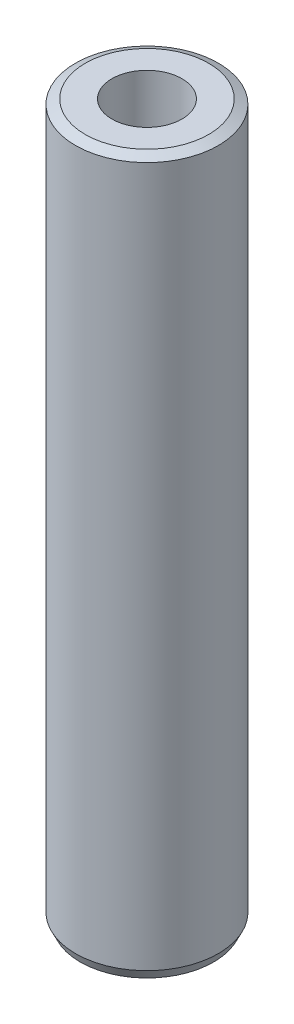
ISO-10303-21;
HEADER;
FILE_DESCRIPTION(('STEP AP214'),'2;1');
FILE_NAME('part.step','',(''),(''),'','','');
FILE_SCHEMA(('AUTOMOTIVE_DESIGN { 1 0 10303 214 1 1 1 1 }'));
ENDSEC;
DATA;
#1=APPLICATION_CONTEXT('core data for automotive mechanical design processes');
#2=APPLICATION_PROTOCOL_DEFINITION('international standard','automotive_design',2000,#1);
#3=PRODUCT_CONTEXT('',#1,'mechanical');
#4=PRODUCT('Part','Part','',(#3));
#5=PRODUCT_RELATED_PRODUCT_CATEGORY('part','',(#4));
#6=PRODUCT_DEFINITION_FORMATION('','',#4);
#7=PRODUCT_DEFINITION_CONTEXT('part definition',#1,'design');
#8=PRODUCT_DEFINITION('design','',#6,#7);
#9=PRODUCT_DEFINITION_SHAPE('','',#8);
#10=(LENGTH_UNIT() NAMED_UNIT(*) SI_UNIT(.MILLI.,.METRE.));
#11=(NAMED_UNIT(*) PLANE_ANGLE_UNIT() SI_UNIT($,.RADIAN.));
#12=(NAMED_UNIT(*) SI_UNIT($,.STERADIAN.) SOLID_ANGLE_UNIT());
#13=UNCERTAINTY_MEASURE_WITH_UNIT(LENGTH_MEASURE(1.E-05),#10,'distance_accuracy_value','');
#14=(GEOMETRIC_REPRESENTATION_CONTEXT(3) GLOBAL_UNCERTAINTY_ASSIGNED_CONTEXT((#13)) GLOBAL_UNIT_ASSIGNED_CONTEXT((#10,
#11,#12)) REPRESENTATION_CONTEXT('',''));
#15=CARTESIAN_POINT('',(0.,0.,0.));
#16=DIRECTION('',(0.,0.,1.));
#17=DIRECTION('',(1.,0.,0.));
#18=AXIS2_PLACEMENT_3D('',#15,#16,#17);
#19=CARTESIAN_POINT('',(0.,600.,0.));
#20=DIRECTION('',(0.,-1.,0.));
#21=DIRECTION('',(0.,0.,-1.));
#22=AXIS2_PLACEMENT_3D('',#19,#20,#21);
#23=CYLINDRICAL_SURFACE('',#22,60.);
#24=CARTESIAN_POINT('',(0.,596.037209363683,0.));
#25=DIRECTION('',(0.,1.,0.));
#26=DIRECTION('',(0.,0.,1.));
#27=AXIS2_PLACEMENT_3D('',#24,#25,#26);
#28=CIRCLE('',#27,60.);
#29=CARTESIAN_POINT('',(0.,596.037209363683,60.));
#30=VERTEX_POINT('',#29);
#31=EDGE_CURVE('E50',#30,#30,#28,.F.);
#32=ORIENTED_EDGE('',*,*,#31,.T.);
#33=EDGE_LOOP('',(#32));
#34=FACE_BOUND('',#33,.T.);
#35=CARTESIAN_POINT('',(0.,8.14249543539736,0.));
#36=DIRECTION('',(0.,1.,0.));
#37=DIRECTION('',(0.,0.,1.));
#38=AXIS2_PLACEMENT_3D('',#35,#36,#37);
#39=CIRCLE('',#38,60.);
#40=CARTESIAN_POINT('',(0.,8.14249543539736,60.));
#41=VERTEX_POINT('',#40);
#42=EDGE_CURVE('E51',#41,#41,#39,.T.);
#43=ORIENTED_EDGE('',*,*,#42,.T.);
#44=EDGE_LOOP('',(#43));
#45=FACE_BOUND('',#44,.T.);
#46=ADVANCED_FACE('F39',(#34,#45),#23,.T.);
#47=CARTESIAN_POINT('',(0.,600.,0.));
#48=DIRECTION('',(0.,1.,0.));
#49=DIRECTION('',(0.,0.,1.));
#50=AXIS2_PLACEMENT_3D('',#47,#48,#49);
#51=PLANE('',#50);
#52=CARTESIAN_POINT('',(0.,600.,0.));
#53=DIRECTION('',(0.,1.,0.));
#54=DIRECTION('',(0.,0.,1.));
#55=AXIS2_PLACEMENT_3D('',#52,#53,#54);
#56=CIRCLE('',#55,51.8575045646034);
#57=CARTESIAN_POINT('',(0.,600.,51.8575045646034));
#58=VERTEX_POINT('',#57);
#59=EDGE_CURVE('E54',#58,#58,#56,.T.);
#60=ORIENTED_EDGE('',*,*,#59,.T.);
#61=EDGE_LOOP('',(#60));
#62=FACE_BOUND('',#61,.T.);
#63=CARTESIAN_POINT('',(0.,600.,0.));
#64=DIRECTION('',(0.,1.,0.));
#65=DIRECTION('',(0.,0.,1.));
#66=AXIS2_PLACEMENT_3D('',#63,#64,#65);
#67=CIRCLE('',#66,29.4147213376394);
#68=CARTESIAN_POINT('',(0.,600.,29.4147213376394));
#69=VERTEX_POINT('',#68);
#70=EDGE_CURVE('E58',#69,#69,#67,.T.);
#71=ORIENTED_EDGE('',*,*,#70,.F.);
#72=EDGE_LOOP('',(#71));
#73=FACE_BOUND('',#72,.T.);
#74=ADVANCED_FACE('F69',(#62,#73),#51,.T.);
#75=CARTESIAN_POINT('',(0.,0.,0.));
#76=DIRECTION('',(0.,1.,0.));
#77=DIRECTION('',(0.,0.,1.));
#78=AXIS2_PLACEMENT_3D('',#75,#76,#77);
#79=PLANE('',#78);
#80=CARTESIAN_POINT('',(0.,0.,0.));
#81=DIRECTION('',(0.,1.,0.));
#82=DIRECTION('',(0.,0.,1.));
#83=AXIS2_PLACEMENT_3D('',#80,#81,#82);
#84=CIRCLE('',#83,56.0372093636828);
#85=CARTESIAN_POINT('',(0.,0.,56.0372093636828));
#86=VERTEX_POINT('',#85);
#87=EDGE_CURVE('E10',#86,#86,#84,.F.);
#88=ORIENTED_EDGE('',*,*,#87,.T.);
#89=EDGE_LOOP('',(#88));
#90=FACE_BOUND('',#89,.T.);
#91=CARTESIAN_POINT('',(0.,0.,0.));
#92=DIRECTION('',(0.,1.,0.));
#93=DIRECTION('',(0.,0.,1.));
#94=AXIS2_PLACEMENT_3D('',#91,#92,#93);
#95=CIRCLE('',#94,29.4147213376394);
#96=CARTESIAN_POINT('',(0.,0.,29.4147213376394));
#97=VERTEX_POINT('',#96);
#98=EDGE_CURVE('E63',#97,#97,#95,.T.);
#99=ORIENTED_EDGE('',*,*,#98,.T.);
#100=EDGE_LOOP('',(#99));
#101=FACE_BOUND('',#100,.T.);
#102=ADVANCED_FACE('F75',(#90,#101),#79,.F.);
#103=CARTESIAN_POINT('',(0.,600.,0.));
#104=DIRECTION('',(0.,-1.,0.));
#105=DIRECTION('',(0.,0.,-1.));
#106=AXIS2_PLACEMENT_3D('',#103,#104,#105);
#107=CYLINDRICAL_SURFACE('',#106,29.4147213376394);
#108=ORIENTED_EDGE('',*,*,#70,.T.);
#109=EDGE_LOOP('',(#108));
#110=FACE_BOUND('',#109,.T.);
#111=ORIENTED_EDGE('',*,*,#98,.F.);
#112=EDGE_LOOP('',(#111));
#113=FACE_BOUND('',#112,.T.);
#114=ADVANCED_FACE('F70',(#110,#113),#107,.F.);
#115=CARTESIAN_POINT('',(0.,600.,0.));
#116=DIRECTION('',(0.,-1.,0.));
#117=DIRECTION('',(0.,0.,-1.));
#118=AXIS2_PLACEMENT_3D('',#115,#116,#117);
#119=CONICAL_SURFACE('',#118,51.8575045646034,1.11786129215627);
#120=ORIENTED_EDGE('',*,*,#31,.F.);
#121=EDGE_LOOP('',(#120));
#122=FACE_BOUND('',#121,.T.);
#123=ORIENTED_EDGE('',*,*,#59,.F.);
#124=EDGE_LOOP('',(#123));
#125=FACE_BOUND('',#124,.T.);
#126=ADVANCED_FACE('F81',(#122,#125),#119,.T.);
#127=CARTESIAN_POINT('',(0.,8.14249543539736,0.));
#128=DIRECTION('',(0.,1.,0.));
#129=DIRECTION('',(0.,0.,1.));
#130=AXIS2_PLACEMENT_3D('',#127,#128,#129);
#131=CONICAL_SURFACE('',#130,60.,0.452935034638629);
#132=ORIENTED_EDGE('',*,*,#87,.F.);
#133=EDGE_LOOP('',(#132));
#134=FACE_BOUND('',#133,.T.);
#135=ORIENTED_EDGE('',*,*,#42,.F.);
#136=EDGE_LOOP('',(#135));
#137=FACE_BOUND('',#136,.T.);
#138=ADVANCED_FACE('F45',(#134,#137),#131,.T.);
#139=CLOSED_SHELL('',(#46,#74,#102,#114,#126,#138));
#140=MANIFOLD_SOLID_BREP('B2',#139);
#141=ADVANCED_BREP_SHAPE_REPRESENTATION('',(#18,#140),#14);
#142=SHAPE_DEFINITION_REPRESENTATION(#9,#141);
ENDSEC;
END-ISO-10303-21;
